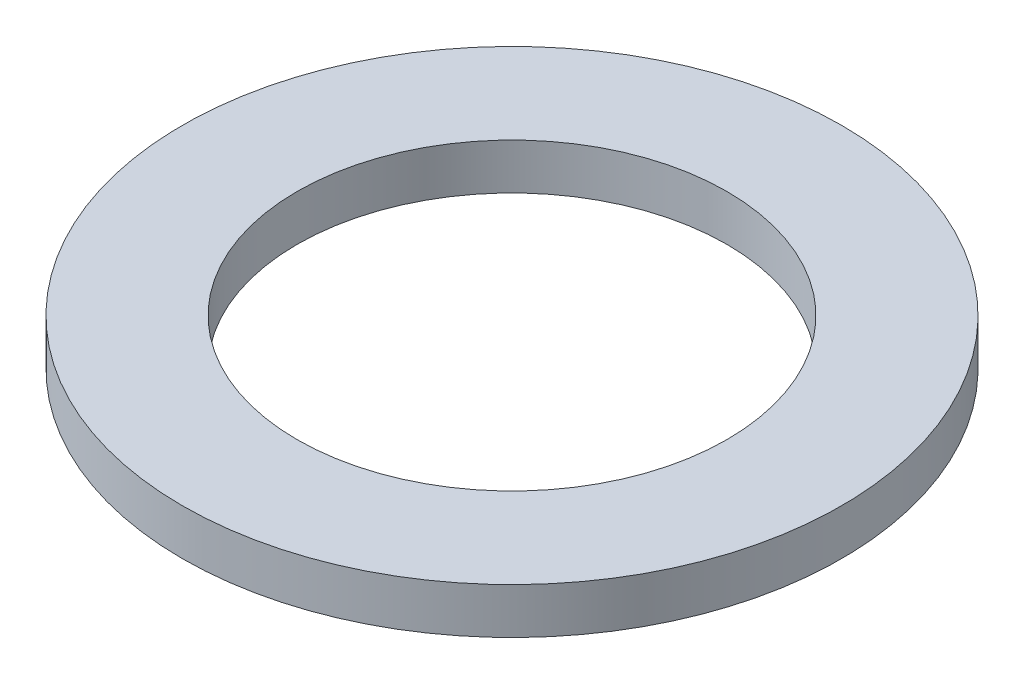
ISO-10303-21;
HEADER;
FILE_DESCRIPTION(('STEP AP214'),'2;1');
FILE_NAME('part.step','',(''),(''),'','','');
FILE_SCHEMA(('AUTOMOTIVE_DESIGN { 1 0 10303 214 1 1 1 1 }'));
ENDSEC;
DATA;
#1=APPLICATION_CONTEXT('core data for automotive mechanical design processes');
#2=APPLICATION_PROTOCOL_DEFINITION('international standard','automotive_design',2000,#1);
#3=PRODUCT_CONTEXT('',#1,'mechanical');
#4=PRODUCT('Part','Part','',(#3));
#5=PRODUCT_RELATED_PRODUCT_CATEGORY('part','',(#4));
#6=PRODUCT_DEFINITION_FORMATION('','',#4);
#7=PRODUCT_DEFINITION_CONTEXT('part definition',#1,'design');
#8=PRODUCT_DEFINITION('design','',#6,#7);
#9=PRODUCT_DEFINITION_SHAPE('','',#8);
#10=(LENGTH_UNIT() NAMED_UNIT(*) SI_UNIT(.MILLI.,.METRE.));
#11=(NAMED_UNIT(*) PLANE_ANGLE_UNIT() SI_UNIT($,.RADIAN.));
#12=(NAMED_UNIT(*) SI_UNIT($,.STERADIAN.) SOLID_ANGLE_UNIT());
#13=UNCERTAINTY_MEASURE_WITH_UNIT(LENGTH_MEASURE(1.E-05),#10,'distance_accuracy_value','');
#14=(GEOMETRIC_REPRESENTATION_CONTEXT(3) GLOBAL_UNCERTAINTY_ASSIGNED_CONTEXT((#13)) GLOBAL_UNIT_ASSIGNED_CONTEXT((#10,
#11,#12)) REPRESENTATION_CONTEXT('',''));
#15=CARTESIAN_POINT('',(0.,0.,0.));
#16=DIRECTION('',(0.,0.,1.));
#17=DIRECTION('',(1.,0.,0.));
#18=AXIS2_PLACEMENT_3D('',#15,#16,#17);
#19=CARTESIAN_POINT('',(0.,8.,0.));
#20=DIRECTION('',(0.,-1.,0.));
#21=DIRECTION('',(0.,0.,-1.));
#22=AXIS2_PLACEMENT_3D('',#19,#20,#21);
#23=CYLINDRICAL_SURFACE('',#22,57.5);
#24=CARTESIAN_POINT('',(0.,8.,0.));
#25=DIRECTION('',(0.,1.,0.));
#26=DIRECTION('',(0.,0.,1.));
#27=AXIS2_PLACEMENT_3D('',#24,#25,#26);
#28=CIRCLE('',#27,57.5);
#29=CARTESIAN_POINT('',(0.,8.,57.5));
#30=VERTEX_POINT('',#29);
#31=EDGE_CURVE('E10',#30,#30,#28,.T.);
#32=ORIENTED_EDGE('',*,*,#31,.F.);
#33=EDGE_LOOP('',(#32));
#34=FACE_BOUND('',#33,.T.);
#35=CARTESIAN_POINT('',(0.,0.,0.));
#36=DIRECTION('',(0.,1.,0.));
#37=DIRECTION('',(0.,0.,1.));
#38=AXIS2_PLACEMENT_3D('',#35,#36,#37);
#39=CIRCLE('',#38,57.5);
#40=CARTESIAN_POINT('',(0.,0.,57.5));
#41=VERTEX_POINT('',#40);
#42=EDGE_CURVE('E37',#41,#41,#39,.T.);
#43=ORIENTED_EDGE('',*,*,#42,.T.);
#44=EDGE_LOOP('',(#43));
#45=FACE_BOUND('',#44,.T.);
#46=ADVANCED_FACE('F40',(#34,#45),#23,.T.);
#47=CARTESIAN_POINT('',(0.,8.,0.));
#48=DIRECTION('',(0.,1.,0.));
#49=DIRECTION('',(0.,0.,1.));
#50=AXIS2_PLACEMENT_3D('',#47,#48,#49);
#51=PLANE('',#50);
#52=CARTESIAN_POINT('',(0.,8.,0.));
#53=DIRECTION('',(0.,1.,0.));
#54=DIRECTION('',(0.,0.,1.));
#55=AXIS2_PLACEMENT_3D('',#52,#53,#54);
#56=CIRCLE('',#55,37.5);
#57=CARTESIAN_POINT('',(0.,8.,37.5));
#58=VERTEX_POINT('',#57);
#59=EDGE_CURVE('E50',#58,#58,#56,.T.);
#60=ORIENTED_EDGE('',*,*,#59,.F.);
#61=EDGE_LOOP('',(#60));
#62=FACE_BOUND('',#61,.T.);
#63=ORIENTED_EDGE('',*,*,#31,.T.);
#64=EDGE_LOOP('',(#63));
#65=FACE_BOUND('',#64,.T.);
#66=ADVANCED_FACE('F59',(#62,#65),#51,.T.);
#67=CARTESIAN_POINT('',(0.,0.,0.));
#68=DIRECTION('',(0.,1.,0.));
#69=DIRECTION('',(0.,0.,1.));
#70=AXIS2_PLACEMENT_3D('',#67,#68,#69);
#71=PLANE('',#70);
#72=CARTESIAN_POINT('',(0.,0.,0.));
#73=DIRECTION('',(0.,1.,0.));
#74=DIRECTION('',(0.,0.,1.));
#75=AXIS2_PLACEMENT_3D('',#72,#73,#74);
#76=CIRCLE('',#75,37.5);
#77=CARTESIAN_POINT('',(0.,0.,37.5));
#78=VERTEX_POINT('',#77);
#79=EDGE_CURVE('E47',#78,#78,#76,.T.);
#80=ORIENTED_EDGE('',*,*,#79,.T.);
#81=EDGE_LOOP('',(#80));
#82=FACE_BOUND('',#81,.T.);
#83=ORIENTED_EDGE('',*,*,#42,.F.);
#84=EDGE_LOOP('',(#83));
#85=FACE_BOUND('',#84,.T.);
#86=ADVANCED_FACE('F58',(#82,#85),#71,.F.);
#87=CARTESIAN_POINT('',(0.,8.,0.));
#88=DIRECTION('',(0.,-1.,0.));
#89=DIRECTION('',(0.,0.,-1.));
#90=AXIS2_PLACEMENT_3D('',#87,#88,#89);
#91=CYLINDRICAL_SURFACE('',#90,37.5);
#92=ORIENTED_EDGE('',*,*,#59,.T.);
#93=EDGE_LOOP('',(#92));
#94=FACE_BOUND('',#93,.T.);
#95=ORIENTED_EDGE('',*,*,#79,.F.);
#96=EDGE_LOOP('',(#95));
#97=FACE_BOUND('',#96,.T.);
#98=ADVANCED_FACE('F54',(#94,#97),#91,.F.);
#99=CLOSED_SHELL('',(#46,#66,#86,#98));
#100=MANIFOLD_SOLID_BREP('B2',#99);
#101=ADVANCED_BREP_SHAPE_REPRESENTATION('',(#18,#100),#14);
#102=SHAPE_DEFINITION_REPRESENTATION(#9,#101);
ENDSEC;
END-ISO-10303-21;
